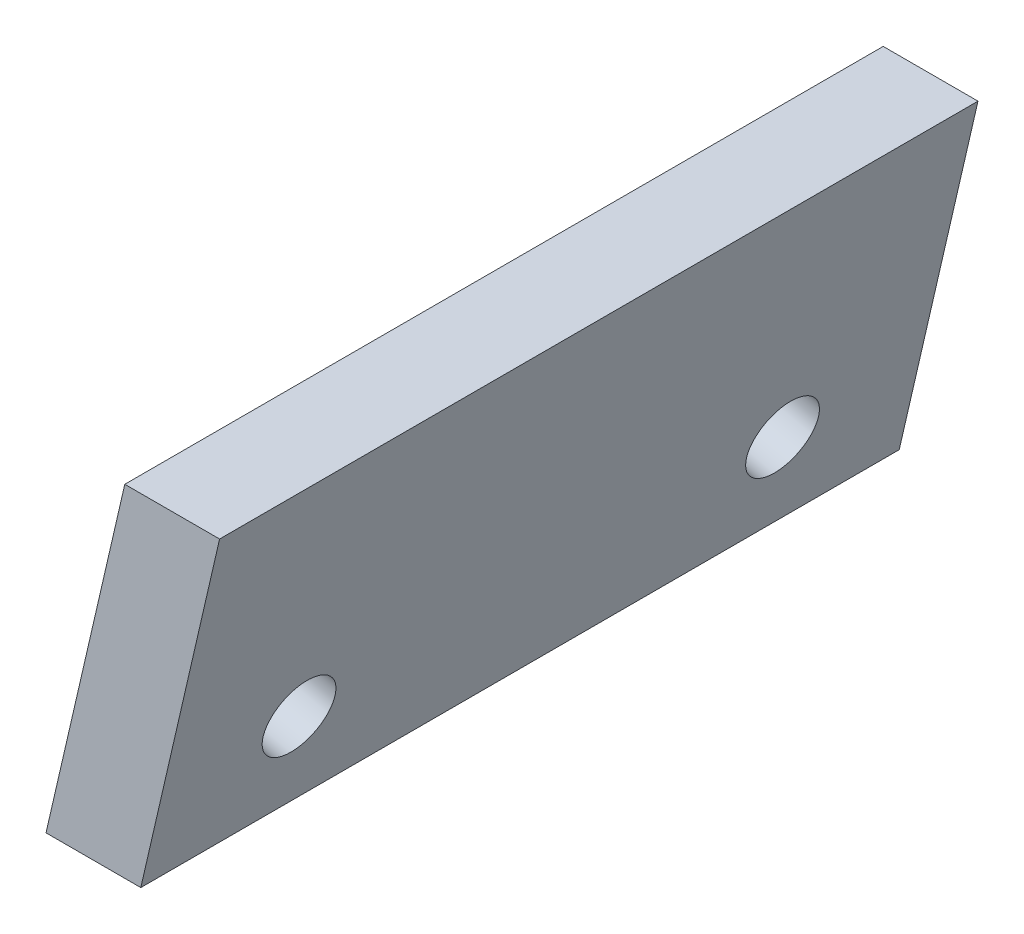
ISO-10303-21;
HEADER;
FILE_DESCRIPTION(('STEP AP214'),'2;1');
FILE_NAME('part.step','',(''),(''),'','','');
FILE_SCHEMA(('AUTOMOTIVE_DESIGN { 1 0 10303 214 1 1 1 1 }'));
ENDSEC;
DATA;
#1=APPLICATION_CONTEXT('core data for automotive mechanical design processes');
#2=APPLICATION_PROTOCOL_DEFINITION('international standard','automotive_design',2000,#1);
#3=PRODUCT_CONTEXT('',#1,'mechanical');
#4=PRODUCT('Part','Part','',(#3));
#5=PRODUCT_RELATED_PRODUCT_CATEGORY('part','',(#4));
#6=PRODUCT_DEFINITION_FORMATION('','',#4);
#7=PRODUCT_DEFINITION_CONTEXT('part definition',#1,'design');
#8=PRODUCT_DEFINITION('design','',#6,#7);
#9=PRODUCT_DEFINITION_SHAPE('','',#8);
#10=(LENGTH_UNIT() NAMED_UNIT(*) SI_UNIT(.MILLI.,.METRE.));
#11=(NAMED_UNIT(*) PLANE_ANGLE_UNIT() SI_UNIT($,.RADIAN.));
#12=(NAMED_UNIT(*) SI_UNIT($,.STERADIAN.) SOLID_ANGLE_UNIT());
#13=UNCERTAINTY_MEASURE_WITH_UNIT(LENGTH_MEASURE(1.E-05),#10,'distance_accuracy_value','');
#14=(GEOMETRIC_REPRESENTATION_CONTEXT(3) GLOBAL_UNCERTAINTY_ASSIGNED_CONTEXT((#13)) GLOBAL_UNIT_ASSIGNED_CONTEXT((#10,
#11,#12)) REPRESENTATION_CONTEXT('',''));
#15=CARTESIAN_POINT('',(0.,0.,0.));
#16=DIRECTION('',(0.,0.,1.));
#17=DIRECTION('',(1.,0.,0.));
#18=AXIS2_PLACEMENT_3D('',#15,#16,#17);
#19=CARTESIAN_POINT('',(0.,0.,20.));
#20=DIRECTION('',(0.974370064785236,-0.224951054343861,0.));
#21=DIRECTION('',(0.224951054343861,0.974370064785236,0.));
#22=AXIS2_PLACEMENT_3D('',#19,#20,#21);
#23=PLANE('',#22);
#24=CARTESIAN_POINT('',(0.674853163031584,2.92311019435571,3.625));
#25=DIRECTION('',(-0.974370064785236,0.224951054343861,0.));
#26=DIRECTION('',(-0.224951054343861,-0.974370064785236,0.));
#27=AXIS2_PLACEMENT_3D('',#24,#25,#26);
#28=CIRCLE('',#27,0.95);
#29=CARTESIAN_POINT('',(0.461149661404916,1.99745863280973,3.625));
#30=VERTEX_POINT('',#29);
#31=EDGE_CURVE('E108',#30,#30,#28,.T.);
#32=ORIENTED_EDGE('',*,*,#31,.F.);
#33=EDGE_LOOP('',(#32));
#34=FACE_BOUND('',#33,.T.);
#35=CARTESIAN_POINT('',(0.674853163031584,2.92311019435571,16.375));
#36=DIRECTION('',(-0.974370064785236,0.224951054343861,0.));
#37=DIRECTION('',(-0.224951054343861,-0.974370064785236,0.));
#38=AXIS2_PLACEMENT_3D('',#35,#36,#37);
#39=CIRCLE('',#38,0.950000000000001);
#40=CARTESIAN_POINT('',(0.461149661404916,1.99745863280973,16.375));
#41=VERTEX_POINT('',#40);
#42=EDGE_CURVE('E113',#41,#41,#39,.T.);
#43=ORIENTED_EDGE('',*,*,#42,.F.);
#44=EDGE_LOOP('',(#43));
#45=FACE_BOUND('',#44,.T.);
#46=DIRECTION('',(-0.224951054343861,-0.974370064785236,0.));
#47=VECTOR('',#46,1.);
#48=CARTESIAN_POINT('',(0.,0.,0.));
#49=LINE('',#48,#47);
#50=CARTESIAN_POINT('',(2.07781372013003,9.,0.));
#51=VERTEX_POINT('',#50);
#52=CARTESIAN_POINT('',(0.,0.,0.));
#53=VERTEX_POINT('',#52);
#54=EDGE_CURVE('E99',#51,#53,#49,.T.);
#55=ORIENTED_EDGE('',*,*,#54,.T.);
#56=DIRECTION('',(0.,0.,-1.));
#57=VECTOR('',#56,1.);
#58=CARTESIAN_POINT('',(0.,0.,20.));
#59=LINE('',#58,#57);
#60=CARTESIAN_POINT('',(0.,0.,20.));
#61=VERTEX_POINT('',#60);
#62=EDGE_CURVE('E11',#61,#53,#59,.T.);
#63=ORIENTED_EDGE('',*,*,#62,.F.);
#64=DIRECTION('',(-0.224951054343861,-0.974370064785236,0.));
#65=VECTOR('',#64,1.);
#66=CARTESIAN_POINT('',(0.,0.,20.));
#67=LINE('',#66,#65);
#68=CARTESIAN_POINT('',(2.07781372013003,9.,20.));
#69=VERTEX_POINT('',#68);
#70=EDGE_CURVE('E86',#69,#61,#67,.T.);
#71=ORIENTED_EDGE('',*,*,#70,.F.);
#72=DIRECTION('',(0.,0.,-1.));
#73=VECTOR('',#72,1.);
#74=CARTESIAN_POINT('',(2.07781372013003,9.,20.));
#75=LINE('',#74,#73);
#76=EDGE_CURVE('E95',#69,#51,#75,.T.);
#77=ORIENTED_EDGE('',*,*,#76,.T.);
#78=EDGE_LOOP('',(#55,#63,#71,#77));
#79=FACE_BOUND('',#78,.T.);
#80=ADVANCED_FACE('F33',(#34,#45,#79),#23,.F.);
#81=CARTESIAN_POINT('',(0.,0.,20.));
#82=DIRECTION('',(0.,1.,0.));
#83=DIRECTION('',(0.,0.,1.));
#84=AXIS2_PLACEMENT_3D('',#81,#82,#83);
#85=PLANE('',#84);
#86=DIRECTION('',(1.,0.,0.));
#87=VECTOR('',#86,1.);
#88=CARTESIAN_POINT('',(0.,0.,0.));
#89=LINE('',#88,#87);
#90=CARTESIAN_POINT('',(2.5,0.,0.));
#91=VERTEX_POINT('',#90);
#92=EDGE_CURVE('E90',#53,#91,#89,.T.);
#93=ORIENTED_EDGE('',*,*,#92,.T.);
#94=DIRECTION('',(0.,0.,-1.));
#95=VECTOR('',#94,1.);
#96=CARTESIAN_POINT('',(2.5,0.,20.));
#97=LINE('',#96,#95);
#98=CARTESIAN_POINT('',(2.5,0.,20.));
#99=VERTEX_POINT('',#98);
#100=EDGE_CURVE('E42',#99,#91,#97,.T.);
#101=ORIENTED_EDGE('',*,*,#100,.F.);
#102=DIRECTION('',(1.,0.,0.));
#103=VECTOR('',#102,1.);
#104=CARTESIAN_POINT('',(0.,0.,20.));
#105=LINE('',#104,#103);
#106=EDGE_CURVE('E81',#61,#99,#105,.T.);
#107=ORIENTED_EDGE('',*,*,#106,.F.);
#108=ORIENTED_EDGE('',*,*,#62,.T.);
#109=EDGE_LOOP('',(#93,#101,#107,#108));
#110=FACE_BOUND('',#109,.T.);
#111=ADVANCED_FACE('F89',(#110),#85,.F.);
#112=CARTESIAN_POINT('',(2.5,0.,20.));
#113=DIRECTION('',(-0.974370064785236,0.224951054343861,0.));
#114=DIRECTION('',(-0.224951054343861,-0.974370064785236,0.));
#115=AXIS2_PLACEMENT_3D('',#112,#113,#114);
#116=PLANE('',#115);
#117=CARTESIAN_POINT('',(3.04834572090555,2.37514626086937,3.625));
#118=DIRECTION('',(-0.974370064785236,0.224951054343861,0.));
#119=DIRECTION('',(-0.224951054343861,-0.974370064785236,0.));
#120=AXIS2_PLACEMENT_3D('',#117,#118,#119);
#121=CIRCLE('',#120,0.95);
#122=CARTESIAN_POINT('',(2.83464221927888,1.4494946993234,3.625));
#123=VERTEX_POINT('',#122);
#124=EDGE_CURVE('E36',#123,#123,#121,.T.);
#125=ORIENTED_EDGE('',*,*,#124,.T.);
#126=EDGE_LOOP('',(#125));
#127=FACE_BOUND('',#126,.T.);
#128=CARTESIAN_POINT('',(3.04834572090555,2.37514626086937,16.375));
#129=DIRECTION('',(-0.974370064785236,0.224951054343861,0.));
#130=DIRECTION('',(-0.224951054343861,-0.974370064785236,0.));
#131=AXIS2_PLACEMENT_3D('',#128,#129,#130);
#132=CIRCLE('',#131,0.950000000000001);
#133=CARTESIAN_POINT('',(2.83464221927888,1.44949469932339,16.375));
#134=VERTEX_POINT('',#133);
#135=EDGE_CURVE('E106',#134,#134,#132,.T.);
#136=ORIENTED_EDGE('',*,*,#135,.T.);
#137=EDGE_LOOP('',(#136));
#138=FACE_BOUND('',#137,.T.);
#139=DIRECTION('',(0.224951054343861,0.974370064785236,0.));
#140=VECTOR('',#139,1.);
#141=CARTESIAN_POINT('',(2.5,0.,0.));
#142=LINE('',#141,#140);
#143=CARTESIAN_POINT('',(4.57781372013003,9.,0.));
#144=VERTEX_POINT('',#143);
#145=EDGE_CURVE('E68',#91,#144,#142,.T.);
#146=ORIENTED_EDGE('',*,*,#145,.T.);
#147=DIRECTION('',(0.,0.,-1.));
#148=VECTOR('',#147,1.);
#149=CARTESIAN_POINT('',(4.57781372013003,9.,20.));
#150=LINE('',#149,#148);
#151=CARTESIAN_POINT('',(4.57781372013003,9.,20.));
#152=VERTEX_POINT('',#151);
#153=EDGE_CURVE('E91',#152,#144,#150,.T.);
#154=ORIENTED_EDGE('',*,*,#153,.F.);
#155=DIRECTION('',(0.224951054343861,0.974370064785236,0.));
#156=VECTOR('',#155,1.);
#157=CARTESIAN_POINT('',(2.5,0.,20.));
#158=LINE('',#157,#156);
#159=EDGE_CURVE('E84',#99,#152,#158,.T.);
#160=ORIENTED_EDGE('',*,*,#159,.F.);
#161=ORIENTED_EDGE('',*,*,#100,.T.);
#162=EDGE_LOOP('',(#146,#154,#160,#161));
#163=FACE_BOUND('',#162,.T.);
#164=ADVANCED_FACE('F93',(#127,#138,#163),#116,.F.);
#165=CARTESIAN_POINT('',(4.57781372013003,9.,20.));
#166=DIRECTION('',(0.,-1.,0.));
#167=DIRECTION('',(1.,0.,0.));
#168=AXIS2_PLACEMENT_3D('',#165,#166,#167);
#169=PLANE('',#168);
#170=DIRECTION('',(-1.,0.,0.));
#171=VECTOR('',#170,1.);
#172=CARTESIAN_POINT('',(4.57781372013003,9.,0.));
#173=LINE('',#172,#171);
#174=EDGE_CURVE('E74',#144,#51,#173,.T.);
#175=ORIENTED_EDGE('',*,*,#174,.T.);
#176=ORIENTED_EDGE('',*,*,#76,.F.);
#177=DIRECTION('',(-1.,0.,0.));
#178=VECTOR('',#177,1.);
#179=CARTESIAN_POINT('',(4.57781372013003,9.,20.));
#180=LINE('',#179,#178);
#181=EDGE_CURVE('E51',#152,#69,#180,.T.);
#182=ORIENTED_EDGE('',*,*,#181,.F.);
#183=ORIENTED_EDGE('',*,*,#153,.T.);
#184=EDGE_LOOP('',(#175,#176,#182,#183));
#185=FACE_BOUND('',#184,.T.);
#186=ADVANCED_FACE('F138',(#185),#169,.F.);
#187=CARTESIAN_POINT('',(0.,0.,20.));
#188=DIRECTION('',(0.,0.,1.));
#189=DIRECTION('',(1.,0.,0.));
#190=AXIS2_PLACEMENT_3D('',#187,#188,#189);
#191=PLANE('',#190);
#192=ORIENTED_EDGE('',*,*,#70,.T.);
#193=ORIENTED_EDGE('',*,*,#106,.T.);
#194=ORIENTED_EDGE('',*,*,#159,.T.);
#195=ORIENTED_EDGE('',*,*,#181,.T.);
#196=EDGE_LOOP('',(#192,#193,#194,#195));
#197=FACE_BOUND('',#196,.T.);
#198=ADVANCED_FACE('F82',(#197),#191,.T.);
#199=CARTESIAN_POINT('',(0.,0.,0.));
#200=DIRECTION('',(0.,0.,1.));
#201=DIRECTION('',(1.,0.,0.));
#202=AXIS2_PLACEMENT_3D('',#199,#200,#201);
#203=PLANE('',#202);
#204=ORIENTED_EDGE('',*,*,#54,.F.);
#205=ORIENTED_EDGE('',*,*,#174,.F.);
#206=ORIENTED_EDGE('',*,*,#145,.F.);
#207=ORIENTED_EDGE('',*,*,#92,.F.);
#208=EDGE_LOOP('',(#204,#205,#206,#207));
#209=FACE_BOUND('',#208,.T.);
#210=ADVANCED_FACE('F129',(#209),#203,.F.);
#211=CARTESIAN_POINT('',(5.02101588145637,1.91971946921564,16.375));
#212=DIRECTION('',(-0.974370064785236,0.224951054343861,0.));
#213=DIRECTION('',(-0.224951054343861,-0.974370064785236,0.));
#214=AXIS2_PLACEMENT_3D('',#211,#212,#213);
#215=CYLINDRICAL_SURFACE('',#214,0.950000000000001);
#216=ORIENTED_EDGE('',*,*,#42,.T.);
#217=EDGE_LOOP('',(#216));
#218=FACE_BOUND('',#217,.T.);
#219=ORIENTED_EDGE('',*,*,#135,.F.);
#220=EDGE_LOOP('',(#219));
#221=FACE_BOUND('',#220,.T.);
#222=ADVANCED_FACE('F121',(#218,#221),#215,.F.);
#223=CARTESIAN_POINT('',(5.02101588145637,1.91971946921564,3.625));
#224=DIRECTION('',(-0.974370064785236,0.224951054343861,0.));
#225=DIRECTION('',(-0.224951054343861,-0.974370064785236,0.));
#226=AXIS2_PLACEMENT_3D('',#223,#224,#225);
#227=CYLINDRICAL_SURFACE('',#226,0.95);
#228=ORIENTED_EDGE('',*,*,#31,.T.);
#229=EDGE_LOOP('',(#228));
#230=FACE_BOUND('',#229,.T.);
#231=ORIENTED_EDGE('',*,*,#124,.F.);
#232=EDGE_LOOP('',(#231));
#233=FACE_BOUND('',#232,.T.);
#234=ADVANCED_FACE('F136',(#230,#233),#227,.F.);
#235=CLOSED_SHELL('',(#80,#111,#164,#186,#198,#210,#222,#234));
#236=MANIFOLD_SOLID_BREP('B2',#235);
#237=ADVANCED_BREP_SHAPE_REPRESENTATION('',(#18,#236),#14);
#238=SHAPE_DEFINITION_REPRESENTATION(#9,#237);
ENDSEC;
END-ISO-10303-21;
